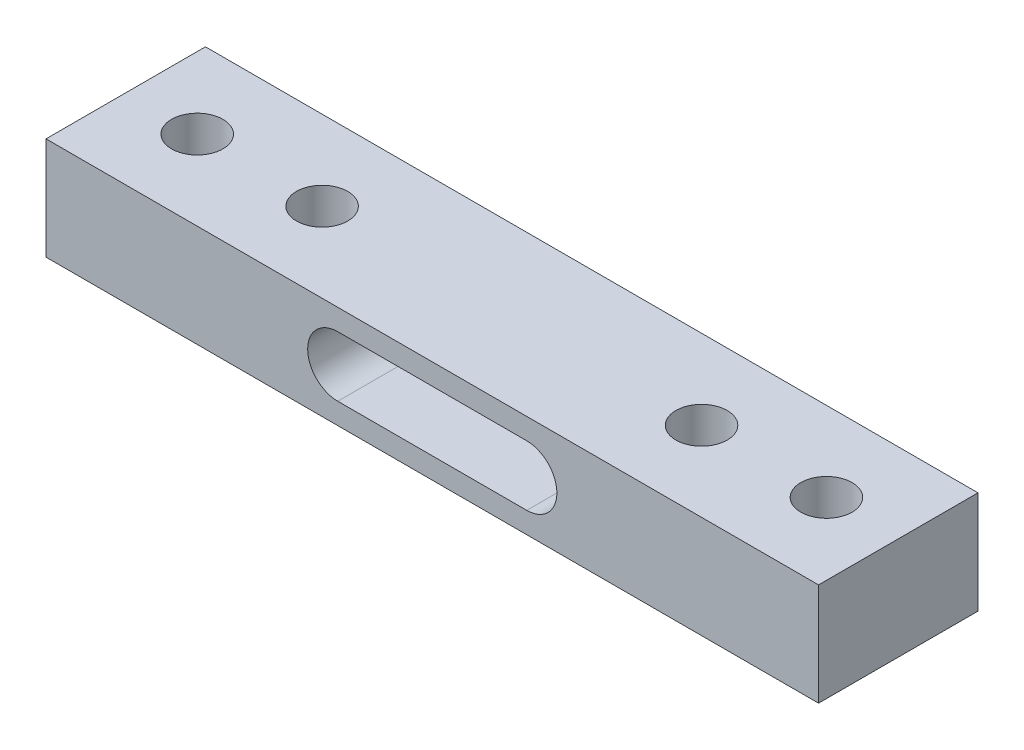
ISO-10303-21;
HEADER;
FILE_DESCRIPTION(('STEP AP214'),'2;1');
FILE_NAME('part.step','',(''),(''),'','','');
FILE_SCHEMA(('AUTOMOTIVE_DESIGN { 1 0 10303 214 1 1 1 1 }'));
ENDSEC;
DATA;
#1=APPLICATION_CONTEXT('core data for automotive mechanical design processes');
#2=APPLICATION_PROTOCOL_DEFINITION('international standard','automotive_design',2000,#1);
#3=PRODUCT_CONTEXT('',#1,'mechanical');
#4=PRODUCT('Part','Part','',(#3));
#5=PRODUCT_RELATED_PRODUCT_CATEGORY('part','',(#4));
#6=PRODUCT_DEFINITION_FORMATION('','',#4);
#7=PRODUCT_DEFINITION_CONTEXT('part definition',#1,'design');
#8=PRODUCT_DEFINITION('design','',#6,#7);
#9=PRODUCT_DEFINITION_SHAPE('','',#8);
#10=(LENGTH_UNIT() NAMED_UNIT(*) SI_UNIT(.MILLI.,.METRE.));
#11=(NAMED_UNIT(*) PLANE_ANGLE_UNIT() SI_UNIT($,.RADIAN.));
#12=(NAMED_UNIT(*) SI_UNIT($,.STERADIAN.) SOLID_ANGLE_UNIT());
#13=UNCERTAINTY_MEASURE_WITH_UNIT(LENGTH_MEASURE(1.E-05),#10,'distance_accuracy_value','');
#14=(GEOMETRIC_REPRESENTATION_CONTEXT(3) GLOBAL_UNCERTAINTY_ASSIGNED_CONTEXT((#13)) GLOBAL_UNIT_ASSIGNED_CONTEXT((#10,
#11,#12)) REPRESENTATION_CONTEXT('',''));
#15=CARTESIAN_POINT('',(0.,0.,0.));
#16=DIRECTION('',(0.,0.,1.));
#17=DIRECTION('',(1.,0.,0.));
#18=AXIS2_PLACEMENT_3D('',#15,#16,#17);
#19=CARTESIAN_POINT('',(0.,0.,9.32));
#20=DIRECTION('',(0.,0.,1.));
#21=DIRECTION('',(1.,0.,0.));
#22=AXIS2_PLACEMENT_3D('',#19,#20,#21);
#23=PLANE('',#22);
#24=DIRECTION('',(0.,1.,0.));
#25=VECTOR('',#24,1.);
#26=CARTESIAN_POINT('',(22.58,2.995,9.32));
#27=LINE('',#26,#25);
#28=CARTESIAN_POINT('',(22.58,-2.995,9.32));
#29=VERTEX_POINT('',#28);
#30=CARTESIAN_POINT('',(22.58,2.995,9.32));
#31=VERTEX_POINT('',#30);
#32=EDGE_CURVE('E136',#29,#31,#27,.T.);
#33=ORIENTED_EDGE('',*,*,#32,.T.);
#34=DIRECTION('',(-1.,0.,0.));
#35=VECTOR('',#34,1.);
#36=CARTESIAN_POINT('',(-22.58,2.995,9.32));
#37=LINE('',#36,#35);
#38=CARTESIAN_POINT('',(-22.58,2.995,9.32));
#39=VERTEX_POINT('',#38);
#40=EDGE_CURVE('E139',#31,#39,#37,.T.);
#41=ORIENTED_EDGE('',*,*,#40,.T.);
#42=DIRECTION('',(0.,-1.,0.));
#43=VECTOR('',#42,1.);
#44=CARTESIAN_POINT('',(-22.58,2.995,9.32));
#45=LINE('',#44,#43);
#46=CARTESIAN_POINT('',(-22.58,-2.995,9.32));
#47=VERTEX_POINT('',#46);
#48=EDGE_CURVE('E142',#39,#47,#45,.T.);
#49=ORIENTED_EDGE('',*,*,#48,.T.);
#50=DIRECTION('',(1.,0.,0.));
#51=VECTOR('',#50,1.);
#52=CARTESIAN_POINT('',(-22.58,-2.995,9.32));
#53=LINE('',#52,#51);
#54=EDGE_CURVE('E144',#47,#29,#53,.T.);
#55=ORIENTED_EDGE('',*,*,#54,.T.);
#56=EDGE_LOOP('',(#33,#41,#49,#55));
#57=FACE_BOUND('',#56,.T.);
#58=DIRECTION('',(-1.,0.,0.));
#59=VECTOR('',#58,1.);
#60=CARTESIAN_POINT('',(5.52363763631545,1.76043586424158,9.32));
#61=LINE('',#60,#59);
#62=CARTESIAN_POINT('',(5.52363763631545,1.76043586424158,9.32));
#63=VERTEX_POINT('',#62);
#64=CARTESIAN_POINT('',(-5.52363763631547,1.76043586424157,9.32));
#65=VERTEX_POINT('',#64);
#66=EDGE_CURVE('E106',#63,#65,#61,.T.);
#67=ORIENTED_EDGE('',*,*,#66,.F.);
#68=CARTESIAN_POINT('',(5.52363763631545,0.,9.32));
#69=DIRECTION('',(0.,0.,1.));
#70=DIRECTION('',(1.,0.,0.));
#71=AXIS2_PLACEMENT_3D('',#68,#69,#70);
#72=CIRCLE('',#71,1.76043586424157);
#73=CARTESIAN_POINT('',(5.52363763631545,-1.76043586424157,9.32));
#74=VERTEX_POINT('',#73);
#75=EDGE_CURVE('E98',#74,#63,#72,.T.);
#76=ORIENTED_EDGE('',*,*,#75,.F.);
#77=DIRECTION('',(1.,0.,0.));
#78=VECTOR('',#77,1.);
#79=CARTESIAN_POINT('',(5.52363763631545,-1.76043586424157,9.32));
#80=LINE('',#79,#78);
#81=CARTESIAN_POINT('',(-5.52363763631547,-1.76043586424157,9.32));
#82=VERTEX_POINT('',#81);
#83=EDGE_CURVE('E120',#82,#74,#80,.T.);
#84=ORIENTED_EDGE('',*,*,#83,.F.);
#85=CARTESIAN_POINT('',(-5.52363763631547,0.,9.32));
#86=DIRECTION('',(0.,0.,1.));
#87=DIRECTION('',(1.,0.,0.));
#88=AXIS2_PLACEMENT_3D('',#85,#86,#87);
#89=CIRCLE('',#88,1.76043586424157);
#90=EDGE_CURVE('E118',#65,#82,#89,.T.);
#91=ORIENTED_EDGE('',*,*,#90,.F.);
#92=EDGE_LOOP('',(#67,#76,#84,#91));
#93=FACE_BOUND('',#92,.T.);
#94=ADVANCED_FACE('F33',(#57,#93),#23,.T.);
#95=CARTESIAN_POINT('',(0.,0.,0.));
#96=DIRECTION('',(0.,0.,1.));
#97=DIRECTION('',(1.,0.,0.));
#98=AXIS2_PLACEMENT_3D('',#95,#96,#97);
#99=PLANE('',#98);
#100=DIRECTION('',(0.,1.,0.));
#101=VECTOR('',#100,1.);
#102=CARTESIAN_POINT('',(22.58,2.995,0.));
#103=LINE('',#102,#101);
#104=CARTESIAN_POINT('',(22.58,-2.995,0.));
#105=VERTEX_POINT('',#104);
#106=CARTESIAN_POINT('',(22.58,2.995,0.));
#107=VERTEX_POINT('',#106);
#108=EDGE_CURVE('E114',#105,#107,#103,.T.);
#109=ORIENTED_EDGE('',*,*,#108,.F.);
#110=DIRECTION('',(1.,0.,0.));
#111=VECTOR('',#110,1.);
#112=CARTESIAN_POINT('',(-22.58,-2.995,0.));
#113=LINE('',#112,#111);
#114=CARTESIAN_POINT('',(-22.58,-2.995,0.));
#115=VERTEX_POINT('',#114);
#116=EDGE_CURVE('E140',#115,#105,#113,.T.);
#117=ORIENTED_EDGE('',*,*,#116,.F.);
#118=DIRECTION('',(0.,-1.,0.));
#119=VECTOR('',#118,1.);
#120=CARTESIAN_POINT('',(-22.58,2.995,0.));
#121=LINE('',#120,#119);
#122=CARTESIAN_POINT('',(-22.58,2.995,0.));
#123=VERTEX_POINT('',#122);
#124=EDGE_CURVE('E151',#123,#115,#121,.T.);
#125=ORIENTED_EDGE('',*,*,#124,.F.);
#126=DIRECTION('',(-1.,0.,0.));
#127=VECTOR('',#126,1.);
#128=CARTESIAN_POINT('',(-22.58,2.995,0.));
#129=LINE('',#128,#127);
#130=EDGE_CURVE('E149',#107,#123,#129,.T.);
#131=ORIENTED_EDGE('',*,*,#130,.F.);
#132=EDGE_LOOP('',(#109,#117,#125,#131));
#133=FACE_BOUND('',#132,.T.);
#134=CARTESIAN_POINT('',(5.52363763631545,0.,0.));
#135=DIRECTION('',(0.,0.,1.));
#136=DIRECTION('',(1.,0.,0.));
#137=AXIS2_PLACEMENT_3D('',#134,#135,#136);
#138=CIRCLE('',#137,1.76043586424157);
#139=CARTESIAN_POINT('',(5.52363763631545,-1.76043586424157,0.));
#140=VERTEX_POINT('',#139);
#141=CARTESIAN_POINT('',(5.52363763631545,1.76043586424158,0.));
#142=VERTEX_POINT('',#141);
#143=EDGE_CURVE('E56',#140,#142,#138,.T.);
#144=ORIENTED_EDGE('',*,*,#143,.T.);
#145=DIRECTION('',(-1.,0.,0.));
#146=VECTOR('',#145,1.);
#147=CARTESIAN_POINT('',(5.52363763631545,1.76043586424158,0.));
#148=LINE('',#147,#146);
#149=CARTESIAN_POINT('',(-5.52363763631547,1.76043586424157,0.));
#150=VERTEX_POINT('',#149);
#151=EDGE_CURVE('E113',#142,#150,#148,.T.);
#152=ORIENTED_EDGE('',*,*,#151,.T.);
#153=CARTESIAN_POINT('',(-5.52363763631547,0.,0.));
#154=DIRECTION('',(0.,0.,1.));
#155=DIRECTION('',(1.,0.,0.));
#156=AXIS2_PLACEMENT_3D('',#153,#154,#155);
#157=CIRCLE('',#156,1.76043586424157);
#158=CARTESIAN_POINT('',(-5.52363763631547,-1.76043586424157,0.));
#159=VERTEX_POINT('',#158);
#160=EDGE_CURVE('E128',#150,#159,#157,.T.);
#161=ORIENTED_EDGE('',*,*,#160,.T.);
#162=DIRECTION('',(1.,0.,0.));
#163=VECTOR('',#162,1.);
#164=CARTESIAN_POINT('',(5.52363763631545,-1.76043586424157,0.));
#165=LINE('',#164,#163);
#166=EDGE_CURVE('E107',#159,#140,#165,.T.);
#167=ORIENTED_EDGE('',*,*,#166,.T.);
#168=EDGE_LOOP('',(#144,#152,#161,#167));
#169=FACE_BOUND('',#168,.T.);
#170=ADVANCED_FACE('F169',(#133,#169),#99,.F.);
#171=CARTESIAN_POINT('',(22.58,2.995,9.32));
#172=DIRECTION('',(-1.,0.,0.));
#173=DIRECTION('',(0.,0.,1.));
#174=AXIS2_PLACEMENT_3D('',#171,#172,#173);
#175=PLANE('',#174);
#176=ORIENTED_EDGE('',*,*,#108,.T.);
#177=DIRECTION('',(0.,0.,-1.));
#178=VECTOR('',#177,1.);
#179=CARTESIAN_POINT('',(22.58,2.995,9.32));
#180=LINE('',#179,#178);
#181=EDGE_CURVE('E11',#31,#107,#180,.T.);
#182=ORIENTED_EDGE('',*,*,#181,.F.);
#183=ORIENTED_EDGE('',*,*,#32,.F.);
#184=DIRECTION('',(0.,0.,-1.));
#185=VECTOR('',#184,1.);
#186=CARTESIAN_POINT('',(22.58,-2.995,9.32));
#187=LINE('',#186,#185);
#188=EDGE_CURVE('E146',#29,#105,#187,.T.);
#189=ORIENTED_EDGE('',*,*,#188,.T.);
#190=EDGE_LOOP('',(#176,#182,#183,#189));
#191=FACE_BOUND('',#190,.T.);
#192=ADVANCED_FACE('F35',(#191),#175,.F.);
#193=CARTESIAN_POINT('',(-22.58,2.995,9.32));
#194=DIRECTION('',(0.,-1.,0.));
#195=DIRECTION('',(1.,0.,0.));
#196=AXIS2_PLACEMENT_3D('',#193,#194,#195);
#197=PLANE('',#196);
#198=CARTESIAN_POINT('',(-18.4,2.995,4.66));
#199=DIRECTION('',(0.,1.,0.));
#200=DIRECTION('',(0.,0.,1.));
#201=AXIS2_PLACEMENT_3D('',#198,#199,#200);
#202=CIRCLE('',#201,1.5);
#203=CARTESIAN_POINT('',(-18.4,2.995,6.16));
#204=VERTEX_POINT('',#203);
#205=EDGE_CURVE('E231',#204,#204,#202,.T.);
#206=ORIENTED_EDGE('',*,*,#205,.F.);
#207=EDGE_LOOP('',(#206));
#208=FACE_BOUND('',#207,.T.);
#209=CARTESIAN_POINT('',(-11.1,2.995,4.66));
#210=DIRECTION('',(0.,1.,0.));
#211=DIRECTION('',(0.,0.,1.));
#212=AXIS2_PLACEMENT_3D('',#209,#210,#211);
#213=CIRCLE('',#212,1.5);
#214=CARTESIAN_POINT('',(-11.1,2.995,6.16));
#215=VERTEX_POINT('',#214);
#216=EDGE_CURVE('E227',#215,#215,#213,.T.);
#217=ORIENTED_EDGE('',*,*,#216,.F.);
#218=EDGE_LOOP('',(#217));
#219=FACE_BOUND('',#218,.T.);
#220=CARTESIAN_POINT('',(11.08,2.995,4.66));
#221=DIRECTION('',(0.,1.,0.));
#222=DIRECTION('',(0.,0.,1.));
#223=AXIS2_PLACEMENT_3D('',#220,#221,#222);
#224=CIRCLE('',#223,1.5);
#225=CARTESIAN_POINT('',(11.08,2.995,6.16));
#226=VERTEX_POINT('',#225);
#227=EDGE_CURVE('E223',#226,#226,#224,.T.);
#228=ORIENTED_EDGE('',*,*,#227,.F.);
#229=EDGE_LOOP('',(#228));
#230=FACE_BOUND('',#229,.T.);
#231=CARTESIAN_POINT('',(18.38,2.995,4.66));
#232=DIRECTION('',(0.,1.,0.));
#233=DIRECTION('',(0.,0.,1.));
#234=AXIS2_PLACEMENT_3D('',#231,#232,#233);
#235=CIRCLE('',#234,1.5);
#236=CARTESIAN_POINT('',(18.38,2.995,6.16));
#237=VERTEX_POINT('',#236);
#238=EDGE_CURVE('E218',#237,#237,#235,.T.);
#239=ORIENTED_EDGE('',*,*,#238,.F.);
#240=EDGE_LOOP('',(#239));
#241=FACE_BOUND('',#240,.T.);
#242=ORIENTED_EDGE('',*,*,#130,.T.);
#243=DIRECTION('',(0.,0.,-1.));
#244=VECTOR('',#243,1.);
#245=CARTESIAN_POINT('',(-22.58,2.995,9.32));
#246=LINE('',#245,#244);
#247=EDGE_CURVE('E41',#39,#123,#246,.T.);
#248=ORIENTED_EDGE('',*,*,#247,.F.);
#249=ORIENTED_EDGE('',*,*,#40,.F.);
#250=ORIENTED_EDGE('',*,*,#181,.T.);
#251=EDGE_LOOP('',(#242,#248,#249,#250));
#252=FACE_BOUND('',#251,.T.);
#253=ADVANCED_FACE('F179',(#208,#219,#230,#241,#252),#197,.F.);
#254=CARTESIAN_POINT('',(-22.58,2.995,9.32));
#255=DIRECTION('',(1.,0.,0.));
#256=DIRECTION('',(0.,0.,-1.));
#257=AXIS2_PLACEMENT_3D('',#254,#255,#256);
#258=PLANE('',#257);
#259=ORIENTED_EDGE('',*,*,#124,.T.);
#260=DIRECTION('',(0.,0.,-1.));
#261=VECTOR('',#260,1.);
#262=CARTESIAN_POINT('',(-22.58,-2.995,9.32));
#263=LINE('',#262,#261);
#264=EDGE_CURVE('E156',#47,#115,#263,.T.);
#265=ORIENTED_EDGE('',*,*,#264,.F.);
#266=ORIENTED_EDGE('',*,*,#48,.F.);
#267=ORIENTED_EDGE('',*,*,#247,.T.);
#268=EDGE_LOOP('',(#259,#265,#266,#267));
#269=FACE_BOUND('',#268,.T.);
#270=ADVANCED_FACE('F163',(#269),#258,.F.);
#271=CARTESIAN_POINT('',(-22.58,-2.995,9.32));
#272=DIRECTION('',(0.,1.,0.));
#273=DIRECTION('',(0.,0.,1.));
#274=AXIS2_PLACEMENT_3D('',#271,#272,#273);
#275=PLANE('',#274);
#276=CARTESIAN_POINT('',(-18.4,-2.995,4.66));
#277=DIRECTION('',(0.,1.,0.));
#278=DIRECTION('',(0.,0.,1.));
#279=AXIS2_PLACEMENT_3D('',#276,#277,#278);
#280=CIRCLE('',#279,1.5);
#281=CARTESIAN_POINT('',(-18.4,-2.995,6.16));
#282=VERTEX_POINT('',#281);
#283=EDGE_CURVE('E206',#282,#282,#280,.T.);
#284=ORIENTED_EDGE('',*,*,#283,.T.);
#285=EDGE_LOOP('',(#284));
#286=FACE_BOUND('',#285,.T.);
#287=CARTESIAN_POINT('',(-11.1,-2.995,4.66));
#288=DIRECTION('',(0.,1.,0.));
#289=DIRECTION('',(0.,0.,1.));
#290=AXIS2_PLACEMENT_3D('',#287,#288,#289);
#291=CIRCLE('',#290,1.5);
#292=CARTESIAN_POINT('',(-11.1,-2.995,6.16));
#293=VERTEX_POINT('',#292);
#294=EDGE_CURVE('E210',#293,#293,#291,.T.);
#295=ORIENTED_EDGE('',*,*,#294,.T.);
#296=EDGE_LOOP('',(#295));
#297=FACE_BOUND('',#296,.T.);
#298=CARTESIAN_POINT('',(11.08,-2.995,4.66));
#299=DIRECTION('',(0.,1.,0.));
#300=DIRECTION('',(0.,0.,1.));
#301=AXIS2_PLACEMENT_3D('',#298,#299,#300);
#302=CIRCLE('',#301,1.5);
#303=CARTESIAN_POINT('',(11.08,-2.995,6.16));
#304=VERTEX_POINT('',#303);
#305=EDGE_CURVE('E214',#304,#304,#302,.T.);
#306=ORIENTED_EDGE('',*,*,#305,.T.);
#307=EDGE_LOOP('',(#306));
#308=FACE_BOUND('',#307,.T.);
#309=CARTESIAN_POINT('',(18.38,-2.995,4.66));
#310=DIRECTION('',(0.,1.,0.));
#311=DIRECTION('',(0.,0.,1.));
#312=AXIS2_PLACEMENT_3D('',#309,#310,#311);
#313=CIRCLE('',#312,1.5);
#314=CARTESIAN_POINT('',(18.38,-2.995,6.16));
#315=VERTEX_POINT('',#314);
#316=EDGE_CURVE('E126',#315,#315,#313,.T.);
#317=ORIENTED_EDGE('',*,*,#316,.T.);
#318=EDGE_LOOP('',(#317));
#319=FACE_BOUND('',#318,.T.);
#320=ORIENTED_EDGE('',*,*,#116,.T.);
#321=ORIENTED_EDGE('',*,*,#188,.F.);
#322=ORIENTED_EDGE('',*,*,#54,.F.);
#323=ORIENTED_EDGE('',*,*,#264,.T.);
#324=EDGE_LOOP('',(#320,#321,#322,#323));
#325=FACE_BOUND('',#324,.T.);
#326=ADVANCED_FACE('F173',(#286,#297,#308,#319,#325),#275,.F.);
#327=CARTESIAN_POINT('',(5.52363763631545,0.,9.32));
#328=DIRECTION('',(0.,0.,-1.));
#329=DIRECTION('',(-1.,0.,0.));
#330=AXIS2_PLACEMENT_3D('',#327,#328,#329);
#331=CYLINDRICAL_SURFACE('',#330,1.76043586424157);
#332=ORIENTED_EDGE('',*,*,#143,.F.);
#333=DIRECTION('',(0.,0.,-1.));
#334=VECTOR('',#333,1.);
#335=CARTESIAN_POINT('',(5.52363763631545,-1.76043586424157,9.32));
#336=LINE('',#335,#334);
#337=EDGE_CURVE('E102',#74,#140,#336,.T.);
#338=ORIENTED_EDGE('',*,*,#337,.F.);
#339=ORIENTED_EDGE('',*,*,#75,.T.);
#340=DIRECTION('',(0.,0.,-1.));
#341=VECTOR('',#340,1.);
#342=CARTESIAN_POINT('',(5.52363763631545,1.76043586424158,9.32));
#343=LINE('',#342,#341);
#344=EDGE_CURVE('E101',#63,#142,#343,.T.);
#345=ORIENTED_EDGE('',*,*,#344,.T.);
#346=EDGE_LOOP('',(#332,#338,#339,#345));
#347=FACE_BOUND('',#346,.T.);
#348=ADVANCED_FACE('F100',(#347),#331,.F.);
#349=CARTESIAN_POINT('',(5.52363763631545,1.76043586424158,9.32));
#350=DIRECTION('',(0.,-1.,0.));
#351=DIRECTION('',(1.,0.,0.));
#352=AXIS2_PLACEMENT_3D('',#349,#350,#351);
#353=PLANE('',#352);
#354=ORIENTED_EDGE('',*,*,#151,.F.);
#355=ORIENTED_EDGE('',*,*,#344,.F.);
#356=ORIENTED_EDGE('',*,*,#66,.T.);
#357=DIRECTION('',(0.,0.,-1.));
#358=VECTOR('',#357,1.);
#359=CARTESIAN_POINT('',(-5.52363763631547,1.76043586424157,9.32));
#360=LINE('',#359,#358);
#361=EDGE_CURVE('E115',#65,#150,#360,.T.);
#362=ORIENTED_EDGE('',*,*,#361,.T.);
#363=EDGE_LOOP('',(#354,#355,#356,#362));
#364=FACE_BOUND('',#363,.T.);
#365=ADVANCED_FACE('F110',(#364),#353,.T.);
#366=CARTESIAN_POINT('',(-5.52363763631547,0.,9.32));
#367=DIRECTION('',(0.,0.,-1.));
#368=DIRECTION('',(-1.,0.,0.));
#369=AXIS2_PLACEMENT_3D('',#366,#367,#368);
#370=CYLINDRICAL_SURFACE('',#369,1.76043586424157);
#371=ORIENTED_EDGE('',*,*,#160,.F.);
#372=ORIENTED_EDGE('',*,*,#361,.F.);
#373=ORIENTED_EDGE('',*,*,#90,.T.);
#374=DIRECTION('',(0.,0.,-1.));
#375=VECTOR('',#374,1.);
#376=CARTESIAN_POINT('',(-5.52363763631547,-1.76043586424157,9.32));
#377=LINE('',#376,#375);
#378=EDGE_CURVE('E48',#82,#159,#377,.T.);
#379=ORIENTED_EDGE('',*,*,#378,.T.);
#380=EDGE_LOOP('',(#371,#372,#373,#379));
#381=FACE_BOUND('',#380,.T.);
#382=ADVANCED_FACE('F256',(#381),#370,.F.);
#383=CARTESIAN_POINT('',(5.52363763631545,-1.76043586424157,9.32));
#384=DIRECTION('',(0.,1.,0.));
#385=DIRECTION('',(-1.,0.,0.));
#386=AXIS2_PLACEMENT_3D('',#383,#384,#385);
#387=PLANE('',#386);
#388=ORIENTED_EDGE('',*,*,#166,.F.);
#389=ORIENTED_EDGE('',*,*,#378,.F.);
#390=ORIENTED_EDGE('',*,*,#83,.T.);
#391=ORIENTED_EDGE('',*,*,#337,.T.);
#392=EDGE_LOOP('',(#388,#389,#390,#391));
#393=FACE_BOUND('',#392,.T.);
#394=ADVANCED_FACE('F252',(#393),#387,.T.);
#395=CARTESIAN_POINT('',(18.38,2.995,4.66));
#396=DIRECTION('',(0.,1.,0.));
#397=DIRECTION('',(0.,0.,1.));
#398=AXIS2_PLACEMENT_3D('',#395,#396,#397);
#399=CYLINDRICAL_SURFACE('',#398,1.5);
#400=ORIENTED_EDGE('',*,*,#238,.T.);
#401=EDGE_LOOP('',(#400));
#402=FACE_BOUND('',#401,.T.);
#403=ORIENTED_EDGE('',*,*,#316,.F.);
#404=EDGE_LOOP('',(#403));
#405=FACE_BOUND('',#404,.T.);
#406=ADVANCED_FACE('F248',(#402,#405),#399,.F.);
#407=CARTESIAN_POINT('',(11.08,2.995,4.66));
#408=DIRECTION('',(0.,1.,0.));
#409=DIRECTION('',(0.,0.,1.));
#410=AXIS2_PLACEMENT_3D('',#407,#408,#409);
#411=CYLINDRICAL_SURFACE('',#410,1.5);
#412=ORIENTED_EDGE('',*,*,#227,.T.);
#413=EDGE_LOOP('',(#412));
#414=FACE_BOUND('',#413,.T.);
#415=ORIENTED_EDGE('',*,*,#305,.F.);
#416=EDGE_LOOP('',(#415));
#417=FACE_BOUND('',#416,.T.);
#418=ADVANCED_FACE('F242',(#414,#417),#411,.F.);
#419=CARTESIAN_POINT('',(-11.1,2.995,4.66));
#420=DIRECTION('',(0.,1.,0.));
#421=DIRECTION('',(0.,0.,1.));
#422=AXIS2_PLACEMENT_3D('',#419,#420,#421);
#423=CYLINDRICAL_SURFACE('',#422,1.5);
#424=ORIENTED_EDGE('',*,*,#216,.T.);
#425=EDGE_LOOP('',(#424));
#426=FACE_BOUND('',#425,.T.);
#427=ORIENTED_EDGE('',*,*,#294,.F.);
#428=EDGE_LOOP('',(#427));
#429=FACE_BOUND('',#428,.T.);
#430=ADVANCED_FACE('F237',(#426,#429),#423,.F.);
#431=CARTESIAN_POINT('',(-18.4,2.995,4.66));
#432=DIRECTION('',(0.,1.,0.));
#433=DIRECTION('',(0.,0.,1.));
#434=AXIS2_PLACEMENT_3D('',#431,#432,#433);
#435=CYLINDRICAL_SURFACE('',#434,1.5);
#436=ORIENTED_EDGE('',*,*,#205,.T.);
#437=EDGE_LOOP('',(#436));
#438=FACE_BOUND('',#437,.T.);
#439=ORIENTED_EDGE('',*,*,#283,.F.);
#440=EDGE_LOOP('',(#439));
#441=FACE_BOUND('',#440,.T.);
#442=ADVANCED_FACE('F234',(#438,#441),#435,.F.);
#443=CLOSED_SHELL('',(#94,#170,#192,#253,#270,#326,#348,#365,#382,#394,#406,#418,#430,#442));
#444=MANIFOLD_SOLID_BREP('B2',#443);
#445=ADVANCED_BREP_SHAPE_REPRESENTATION('',(#18,#444),#14);
#446=SHAPE_DEFINITION_REPRESENTATION(#9,#445);
ENDSEC;
END-ISO-10303-21;
